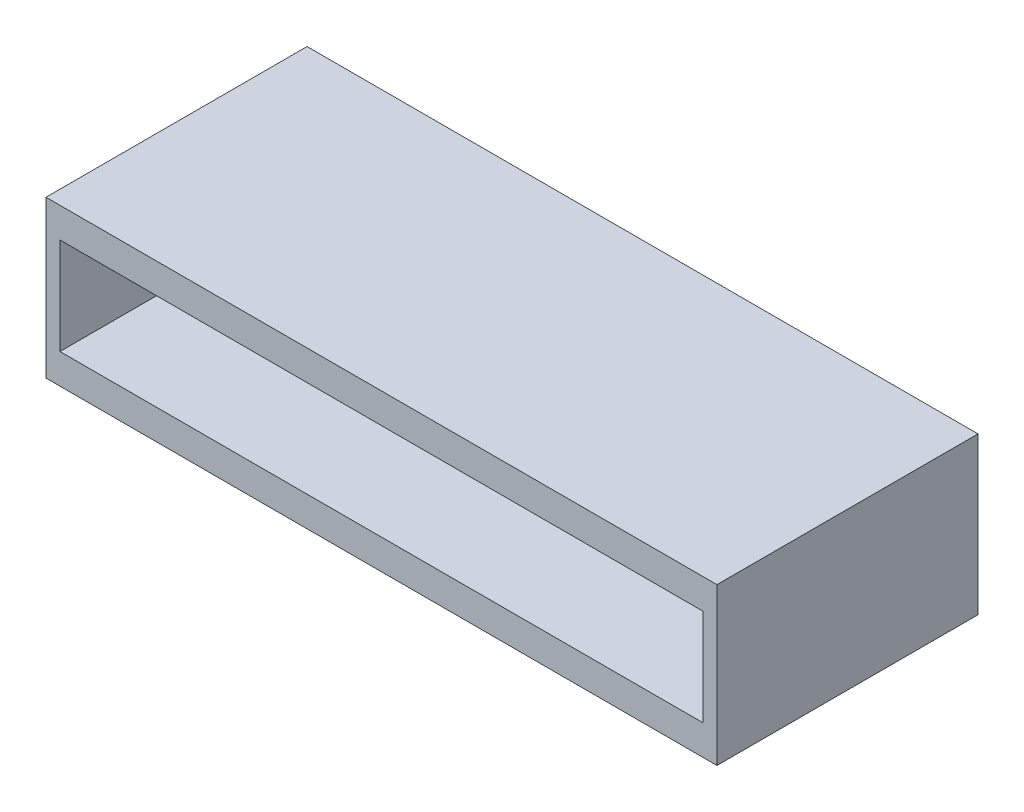
ISO-10303-21;
HEADER;
FILE_DESCRIPTION(('STEP AP214'),'2;1');
FILE_NAME('part.step','',(''),(''),'','','');
FILE_SCHEMA(('AUTOMOTIVE_DESIGN { 1 0 10303 214 1 1 1 1 }'));
ENDSEC;
DATA;
#1=APPLICATION_CONTEXT('core data for automotive mechanical design processes');
#2=APPLICATION_PROTOCOL_DEFINITION('international standard','automotive_design',2000,#1);
#3=PRODUCT_CONTEXT('',#1,'mechanical');
#4=PRODUCT('Part','Part','',(#3));
#5=PRODUCT_RELATED_PRODUCT_CATEGORY('part','',(#4));
#6=PRODUCT_DEFINITION_FORMATION('','',#4);
#7=PRODUCT_DEFINITION_CONTEXT('part definition',#1,'design');
#8=PRODUCT_DEFINITION('design','',#6,#7);
#9=PRODUCT_DEFINITION_SHAPE('','',#8);
#10=(LENGTH_UNIT() NAMED_UNIT(*) SI_UNIT(.MILLI.,.METRE.));
#11=(NAMED_UNIT(*) PLANE_ANGLE_UNIT() SI_UNIT($,.RADIAN.));
#12=(NAMED_UNIT(*) SI_UNIT($,.STERADIAN.) SOLID_ANGLE_UNIT());
#13=UNCERTAINTY_MEASURE_WITH_UNIT(LENGTH_MEASURE(1.E-05),#10,'distance_accuracy_value','');
#14=(GEOMETRIC_REPRESENTATION_CONTEXT(3) GLOBAL_UNCERTAINTY_ASSIGNED_CONTEXT((#13)) GLOBAL_UNIT_ASSIGNED_CONTEXT((#10,
#11,#12)) REPRESENTATION_CONTEXT('',''));
#15=CARTESIAN_POINT('',(0.,0.,0.));
#16=DIRECTION('',(0.,0.,1.));
#17=DIRECTION('',(1.,0.,0.));
#18=AXIS2_PLACEMENT_3D('',#15,#16,#17);
#19=CARTESIAN_POINT('',(6.425,1.5,-2.5));
#20=DIRECTION('',(-1.,0.,0.));
#21=DIRECTION('',(0.,0.,1.));
#22=AXIS2_PLACEMENT_3D('',#19,#20,#21);
#23=PLANE('',#22);
#24=DIRECTION('',(0.,0.,-1.));
#25=VECTOR('',#24,1.);
#26=CARTESIAN_POINT('',(6.425,-1.5,-2.5));
#27=LINE('',#26,#25);
#28=CARTESIAN_POINT('',(6.425,-1.5,2.5));
#29=VERTEX_POINT('',#28);
#30=CARTESIAN_POINT('',(6.425,-1.5,-2.5));
#31=VERTEX_POINT('',#30);
#32=EDGE_CURVE('E142',#29,#31,#27,.T.);
#33=ORIENTED_EDGE('',*,*,#32,.T.);
#34=DIRECTION('',(0.,-1.,0.));
#35=VECTOR('',#34,1.);
#36=CARTESIAN_POINT('',(6.425,1.5,-2.5));
#37=LINE('',#36,#35);
#38=CARTESIAN_POINT('',(6.425,1.5,-2.5));
#39=VERTEX_POINT('',#38);
#40=EDGE_CURVE('E11',#39,#31,#37,.T.);
#41=ORIENTED_EDGE('',*,*,#40,.F.);
#42=DIRECTION('',(0.,0.,-1.));
#43=VECTOR('',#42,1.);
#44=CARTESIAN_POINT('',(6.425,1.5,-2.5));
#45=LINE('',#44,#43);
#46=CARTESIAN_POINT('',(6.425,1.5,2.5));
#47=VERTEX_POINT('',#46);
#48=EDGE_CURVE('E146',#47,#39,#45,.T.);
#49=ORIENTED_EDGE('',*,*,#48,.F.);
#50=DIRECTION('',(0.,-1.,0.));
#51=VECTOR('',#50,1.);
#52=CARTESIAN_POINT('',(6.425,1.5,2.5));
#53=LINE('',#52,#51);
#54=EDGE_CURVE('E152',#47,#29,#53,.T.);
#55=ORIENTED_EDGE('',*,*,#54,.T.);
#56=EDGE_LOOP('',(#33,#41,#49,#55));
#57=FACE_BOUND('',#56,.T.);
#58=ADVANCED_FACE('F34',(#57),#23,.F.);
#59=CARTESIAN_POINT('',(-6.425,1.5,-2.5));
#60=DIRECTION('',(0.,0.,1.));
#61=DIRECTION('',(1.,0.,0.));
#62=AXIS2_PLACEMENT_3D('',#59,#60,#61);
#63=PLANE('',#62);
#64=DIRECTION('',(-1.,0.,0.));
#65=VECTOR('',#64,1.);
#66=CARTESIAN_POINT('',(-6.425,-1.5,-2.5));
#67=LINE('',#66,#65);
#68=CARTESIAN_POINT('',(-6.425,-1.5,-2.5));
#69=VERTEX_POINT('',#68);
#70=EDGE_CURVE('E155',#31,#69,#67,.T.);
#71=ORIENTED_EDGE('',*,*,#70,.T.);
#72=DIRECTION('',(0.,-1.,0.));
#73=VECTOR('',#72,1.);
#74=CARTESIAN_POINT('',(-6.425,1.5,-2.5));
#75=LINE('',#74,#73);
#76=CARTESIAN_POINT('',(-6.425,1.5,-2.5));
#77=VERTEX_POINT('',#76);
#78=EDGE_CURVE('E41',#77,#69,#75,.T.);
#79=ORIENTED_EDGE('',*,*,#78,.F.);
#80=DIRECTION('',(-1.,0.,0.));
#81=VECTOR('',#80,1.);
#82=CARTESIAN_POINT('',(-6.425,1.5,-2.5));
#83=LINE('',#82,#81);
#84=EDGE_CURVE('E85',#39,#77,#83,.T.);
#85=ORIENTED_EDGE('',*,*,#84,.F.);
#86=ORIENTED_EDGE('',*,*,#40,.T.);
#87=EDGE_LOOP('',(#71,#79,#85,#86));
#88=FACE_BOUND('',#87,.T.);
#89=ADVANCED_FACE('F184',(#88),#63,.F.);
#90=CARTESIAN_POINT('',(-6.425,1.5,-2.5));
#91=DIRECTION('',(1.,0.,0.));
#92=DIRECTION('',(0.,0.,-1.));
#93=AXIS2_PLACEMENT_3D('',#90,#91,#92);
#94=PLANE('',#93);
#95=DIRECTION('',(0.,0.,1.));
#96=VECTOR('',#95,1.);
#97=CARTESIAN_POINT('',(-6.425,-1.5,-2.5));
#98=LINE('',#97,#96);
#99=CARTESIAN_POINT('',(-6.425,-1.5,2.5));
#100=VERTEX_POINT('',#99);
#101=EDGE_CURVE('E157',#69,#100,#98,.T.);
#102=ORIENTED_EDGE('',*,*,#101,.T.);
#103=DIRECTION('',(0.,-1.,0.));
#104=VECTOR('',#103,1.);
#105=CARTESIAN_POINT('',(-6.425,1.5,2.5));
#106=LINE('',#105,#104);
#107=CARTESIAN_POINT('',(-6.425,1.5,2.5));
#108=VERTEX_POINT('',#107);
#109=EDGE_CURVE('E161',#108,#100,#106,.T.);
#110=ORIENTED_EDGE('',*,*,#109,.F.);
#111=DIRECTION('',(0.,0.,1.));
#112=VECTOR('',#111,1.);
#113=CARTESIAN_POINT('',(-6.425,1.5,-2.5));
#114=LINE('',#113,#112);
#115=EDGE_CURVE('E149',#77,#108,#114,.T.);
#116=ORIENTED_EDGE('',*,*,#115,.F.);
#117=ORIENTED_EDGE('',*,*,#78,.T.);
#118=EDGE_LOOP('',(#102,#110,#116,#117));
#119=FACE_BOUND('',#118,.T.);
#120=ADVANCED_FACE('F166',(#119),#94,.F.);
#121=CARTESIAN_POINT('',(-6.425,1.5,2.5));
#122=DIRECTION('',(0.,0.,-1.));
#123=DIRECTION('',(-1.,0.,0.));
#124=AXIS2_PLACEMENT_3D('',#121,#122,#123);
#125=PLANE('',#124);
#126=DIRECTION('',(-1.,0.,0.));
#127=VECTOR('',#126,1.);
#128=CARTESIAN_POINT('',(-6.15745755549131,0.925,2.5));
#129=LINE('',#128,#127);
#130=CARTESIAN_POINT('',(6.15745755549131,0.925,2.5));
#131=VERTEX_POINT('',#130);
#132=CARTESIAN_POINT('',(-6.15745755549131,0.925,2.5));
#133=VERTEX_POINT('',#132);
#134=EDGE_CURVE('E136',#131,#133,#129,.T.);
#135=ORIENTED_EDGE('',*,*,#134,.F.);
#136=DIRECTION('',(0.,1.,0.));
#137=VECTOR('',#136,1.);
#138=CARTESIAN_POINT('',(6.15745755549131,0.925,2.5));
#139=LINE('',#138,#137);
#140=CARTESIAN_POINT('',(6.15745755549131,-0.925,2.5));
#141=VERTEX_POINT('',#140);
#142=EDGE_CURVE('E48',#141,#131,#139,.T.);
#143=ORIENTED_EDGE('',*,*,#142,.F.);
#144=DIRECTION('',(1.,0.,0.));
#145=VECTOR('',#144,1.);
#146=CARTESIAN_POINT('',(-6.15745755549131,-0.925,2.5));
#147=LINE('',#146,#145);
#148=CARTESIAN_POINT('',(-6.15745755549131,-0.925,2.5));
#149=VERTEX_POINT('',#148);
#150=EDGE_CURVE('E127',#149,#141,#147,.T.);
#151=ORIENTED_EDGE('',*,*,#150,.F.);
#152=DIRECTION('',(0.,-1.,0.));
#153=VECTOR('',#152,1.);
#154=CARTESIAN_POINT('',(-6.15745755549131,0.925,2.5));
#155=LINE('',#154,#153);
#156=EDGE_CURVE('E130',#133,#149,#155,.T.);
#157=ORIENTED_EDGE('',*,*,#156,.F.);
#158=EDGE_LOOP('',(#135,#143,#151,#157));
#159=FACE_BOUND('',#158,.T.);
#160=DIRECTION('',(1.,0.,0.));
#161=VECTOR('',#160,1.);
#162=CARTESIAN_POINT('',(-6.425,-1.5,2.5));
#163=LINE('',#162,#161);
#164=EDGE_CURVE('E78',#100,#29,#163,.T.);
#165=ORIENTED_EDGE('',*,*,#164,.T.);
#166=ORIENTED_EDGE('',*,*,#54,.F.);
#167=DIRECTION('',(1.,0.,0.));
#168=VECTOR('',#167,1.);
#169=CARTESIAN_POINT('',(-6.425,1.5,2.5));
#170=LINE('',#169,#168);
#171=EDGE_CURVE('E57',#108,#47,#170,.T.);
#172=ORIENTED_EDGE('',*,*,#171,.F.);
#173=ORIENTED_EDGE('',*,*,#109,.T.);
#174=EDGE_LOOP('',(#165,#166,#172,#173));
#175=FACE_BOUND('',#174,.T.);
#176=ADVANCED_FACE('F174',(#159,#175),#125,.F.);
#177=CARTESIAN_POINT('',(0.,1.5,0.));
#178=DIRECTION('',(0.,1.,0.));
#179=DIRECTION('',(0.,0.,1.));
#180=AXIS2_PLACEMENT_3D('',#177,#178,#179);
#181=PLANE('',#180);
#182=ORIENTED_EDGE('',*,*,#48,.T.);
#183=ORIENTED_EDGE('',*,*,#84,.T.);
#184=ORIENTED_EDGE('',*,*,#115,.T.);
#185=ORIENTED_EDGE('',*,*,#171,.T.);
#186=EDGE_LOOP('',(#182,#183,#184,#185));
#187=FACE_BOUND('',#186,.T.);
#188=ADVANCED_FACE('F176',(#187),#181,.T.);
#189=CARTESIAN_POINT('',(0.,-1.5,0.));
#190=DIRECTION('',(0.,1.,0.));
#191=DIRECTION('',(0.,0.,1.));
#192=AXIS2_PLACEMENT_3D('',#189,#190,#191);
#193=PLANE('',#192);
#194=ORIENTED_EDGE('',*,*,#32,.F.);
#195=ORIENTED_EDGE('',*,*,#164,.F.);
#196=ORIENTED_EDGE('',*,*,#101,.F.);
#197=ORIENTED_EDGE('',*,*,#70,.F.);
#198=EDGE_LOOP('',(#194,#195,#196,#197));
#199=FACE_BOUND('',#198,.T.);
#200=ADVANCED_FACE('F170',(#199),#193,.F.);
#201=CARTESIAN_POINT('',(6.15745755549131,0.925,-1.));
#202=DIRECTION('',(1.,0.,0.));
#203=DIRECTION('',(0.,0.,-1.));
#204=AXIS2_PLACEMENT_3D('',#201,#202,#203);
#205=PLANE('',#204);
#206=ORIENTED_EDGE('',*,*,#142,.T.);
#207=DIRECTION('',(0.,0.,1.));
#208=VECTOR('',#207,1.);
#209=CARTESIAN_POINT('',(6.15745755549131,0.925,-1.));
#210=LINE('',#209,#208);
#211=CARTESIAN_POINT('',(6.15745755549131,0.925,-1.));
#212=VERTEX_POINT('',#211);
#213=EDGE_CURVE('E105',#212,#131,#210,.T.);
#214=ORIENTED_EDGE('',*,*,#213,.F.);
#215=DIRECTION('',(0.,1.,0.));
#216=VECTOR('',#215,1.);
#217=CARTESIAN_POINT('',(6.15745755549131,0.925,-1.));
#218=LINE('',#217,#216);
#219=CARTESIAN_POINT('',(6.15745755549131,-0.925,-1.));
#220=VERTEX_POINT('',#219);
#221=EDGE_CURVE('E109',#220,#212,#218,.T.);
#222=ORIENTED_EDGE('',*,*,#221,.F.);
#223=DIRECTION('',(0.,0.,1.));
#224=VECTOR('',#223,1.);
#225=CARTESIAN_POINT('',(6.15745755549131,-0.925,-1.));
#226=LINE('',#225,#224);
#227=EDGE_CURVE('E140',#220,#141,#226,.T.);
#228=ORIENTED_EDGE('',*,*,#227,.T.);
#229=EDGE_LOOP('',(#206,#214,#222,#228));
#230=FACE_BOUND('',#229,.T.);
#231=ADVANCED_FACE('F107',(#230),#205,.F.);
#232=CARTESIAN_POINT('',(-6.15745755549131,-0.925,-1.));
#233=DIRECTION('',(0.,-1.,0.));
#234=DIRECTION('',(0.,0.,-1.));
#235=AXIS2_PLACEMENT_3D('',#232,#233,#234);
#236=PLANE('',#235);
#237=ORIENTED_EDGE('',*,*,#150,.T.);
#238=ORIENTED_EDGE('',*,*,#227,.F.);
#239=DIRECTION('',(1.,0.,0.));
#240=VECTOR('',#239,1.);
#241=CARTESIAN_POINT('',(-6.15745755549131,-0.925,-1.));
#242=LINE('',#241,#240);
#243=CARTESIAN_POINT('',(-6.15745755549131,-0.925,-1.));
#244=VERTEX_POINT('',#243);
#245=EDGE_CURVE('E115',#244,#220,#242,.T.);
#246=ORIENTED_EDGE('',*,*,#245,.F.);
#247=DIRECTION('',(0.,0.,1.));
#248=VECTOR('',#247,1.);
#249=CARTESIAN_POINT('',(-6.15745755549131,-0.925,-1.));
#250=LINE('',#249,#248);
#251=EDGE_CURVE('E143',#244,#149,#250,.T.);
#252=ORIENTED_EDGE('',*,*,#251,.T.);
#253=EDGE_LOOP('',(#237,#238,#246,#252));
#254=FACE_BOUND('',#253,.T.);
#255=ADVANCED_FACE('F223',(#254),#236,.F.);
#256=CARTESIAN_POINT('',(-6.15745755549131,0.925,-1.));
#257=DIRECTION('',(-1.,0.,0.));
#258=DIRECTION('',(0.,-1.,0.));
#259=AXIS2_PLACEMENT_3D('',#256,#257,#258);
#260=PLANE('',#259);
#261=ORIENTED_EDGE('',*,*,#156,.T.);
#262=ORIENTED_EDGE('',*,*,#251,.F.);
#263=DIRECTION('',(0.,-1.,0.));
#264=VECTOR('',#263,1.);
#265=CARTESIAN_POINT('',(-6.15745755549131,0.925,-1.));
#266=LINE('',#265,#264);
#267=CARTESIAN_POINT('',(-6.15745755549131,0.925,-1.));
#268=VERTEX_POINT('',#267);
#269=EDGE_CURVE('E123',#268,#244,#266,.T.);
#270=ORIENTED_EDGE('',*,*,#269,.F.);
#271=DIRECTION('',(0.,0.,1.));
#272=VECTOR('',#271,1.);
#273=CARTESIAN_POINT('',(-6.15745755549131,0.925,-1.));
#274=LINE('',#273,#272);
#275=EDGE_CURVE('E114',#268,#133,#274,.T.);
#276=ORIENTED_EDGE('',*,*,#275,.T.);
#277=EDGE_LOOP('',(#261,#262,#270,#276));
#278=FACE_BOUND('',#277,.T.);
#279=ADVANCED_FACE('F232',(#278),#260,.F.);
#280=CARTESIAN_POINT('',(-6.15745755549131,0.925,-1.));
#281=DIRECTION('',(0.,1.,0.));
#282=DIRECTION('',(0.,0.,1.));
#283=AXIS2_PLACEMENT_3D('',#280,#281,#282);
#284=PLANE('',#283);
#285=ORIENTED_EDGE('',*,*,#134,.T.);
#286=ORIENTED_EDGE('',*,*,#275,.F.);
#287=DIRECTION('',(-1.,0.,0.));
#288=VECTOR('',#287,1.);
#289=CARTESIAN_POINT('',(-6.15745755549131,0.925,-1.));
#290=LINE('',#289,#288);
#291=EDGE_CURVE('E118',#212,#268,#290,.T.);
#292=ORIENTED_EDGE('',*,*,#291,.F.);
#293=ORIENTED_EDGE('',*,*,#213,.T.);
#294=EDGE_LOOP('',(#285,#286,#292,#293));
#295=FACE_BOUND('',#294,.T.);
#296=ADVANCED_FACE('F119',(#295),#284,.F.);
#297=CARTESIAN_POINT('',(0.,0.,-1.));
#298=DIRECTION('',(0.,0.,1.));
#299=DIRECTION('',(1.,0.,0.));
#300=AXIS2_PLACEMENT_3D('',#297,#298,#299);
#301=PLANE('',#300);
#302=ORIENTED_EDGE('',*,*,#221,.T.);
#303=ORIENTED_EDGE('',*,*,#291,.T.);
#304=ORIENTED_EDGE('',*,*,#269,.T.);
#305=ORIENTED_EDGE('',*,*,#245,.T.);
#306=EDGE_LOOP('',(#302,#303,#304,#305));
#307=FACE_BOUND('',#306,.T.);
#308=ADVANCED_FACE('F125',(#307),#301,.T.);
#309=CLOSED_SHELL('',(#58,#89,#120,#176,#188,#200,#231,#255,#279,#296,#308));
#310=MANIFOLD_SOLID_BREP('B2',#309);
#311=ADVANCED_BREP_SHAPE_REPRESENTATION('',(#18,#310),#14);
#312=SHAPE_DEFINITION_REPRESENTATION(#9,#311);
ENDSEC;
END-ISO-10303-21;
